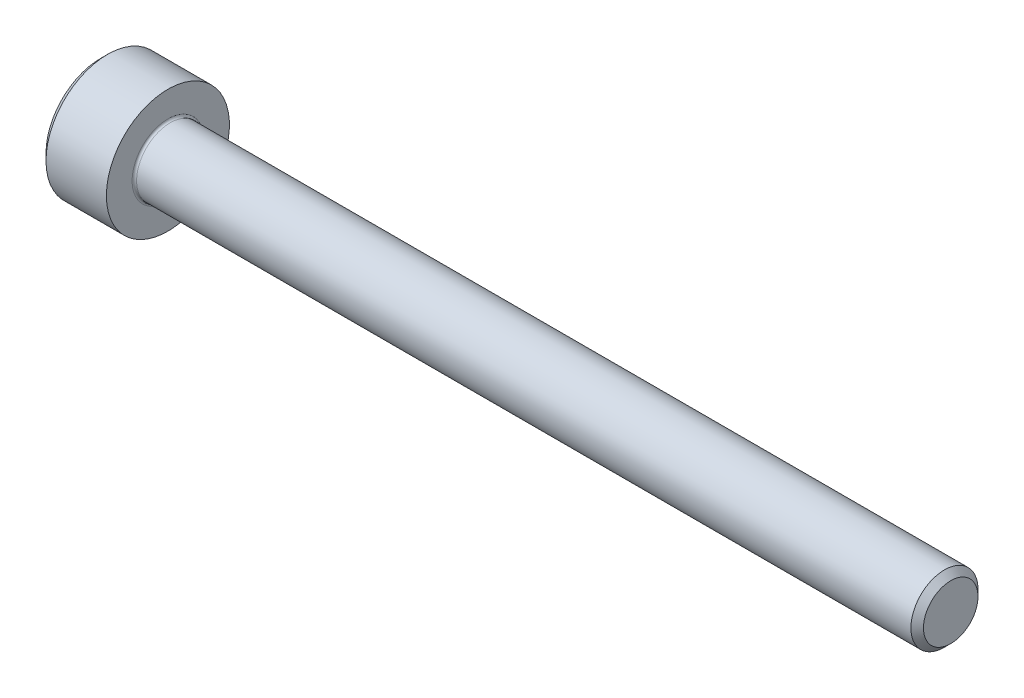
ISO-10303-21;
HEADER;
FILE_DESCRIPTION(('STEP AP214'),'2;1');
FILE_NAME('part.step','',(''),(''),'','','');
FILE_SCHEMA(('AUTOMOTIVE_DESIGN { 1 0 10303 214 1 1 1 1 }'));
ENDSEC;
DATA;
#1=APPLICATION_CONTEXT('core data for automotive mechanical design processes');
#2=APPLICATION_PROTOCOL_DEFINITION('international standard','automotive_design',2000,#1);
#3=PRODUCT_CONTEXT('',#1,'mechanical');
#4=PRODUCT('Part','Part','',(#3));
#5=PRODUCT_RELATED_PRODUCT_CATEGORY('part','',(#4));
#6=PRODUCT_DEFINITION_FORMATION('','',#4);
#7=PRODUCT_DEFINITION_CONTEXT('part definition',#1,'design');
#8=PRODUCT_DEFINITION('design','',#6,#7);
#9=PRODUCT_DEFINITION_SHAPE('','',#8);
#10=(LENGTH_UNIT() NAMED_UNIT(*) SI_UNIT(.MILLI.,.METRE.));
#11=(NAMED_UNIT(*) PLANE_ANGLE_UNIT() SI_UNIT($,.RADIAN.));
#12=(NAMED_UNIT(*) SI_UNIT($,.STERADIAN.) SOLID_ANGLE_UNIT());
#13=UNCERTAINTY_MEASURE_WITH_UNIT(LENGTH_MEASURE(1.E-05),#10,'distance_accuracy_value','');
#14=(GEOMETRIC_REPRESENTATION_CONTEXT(3) GLOBAL_UNCERTAINTY_ASSIGNED_CONTEXT((#13)) GLOBAL_UNIT_ASSIGNED_CONTEXT((#10,
#11,#12)) REPRESENTATION_CONTEXT('',''));
#15=CARTESIAN_POINT('',(0.,0.,0.));
#16=DIRECTION('',(0.,0.,1.));
#17=DIRECTION('',(1.,0.,0.));
#18=AXIS2_PLACEMENT_3D('',#15,#16,#17);
#19=CARTESIAN_POINT('',(0.,0.,0.));
#20=DIRECTION('',(-1.,0.,0.));
#21=DIRECTION('',(0.,0.,1.));
#22=AXIS2_PLACEMENT_3D('',#19,#20,#21);
#23=PLANE('',#22);
#24=DIRECTION('',(0.,-0.5,0.86602540378444));
#25=VECTOR('',#24,1.);
#26=CARTESIAN_POINT('',(0.,1.47801668912544,0.));
#27=LINE('',#26,#25);
#28=CARTESIAN_POINT('',(0.,1.47801668912544,0.));
#29=VERTEX_POINT('',#28);
#30=CARTESIAN_POINT('',(0.,0.73900834456272,1.28));
#31=VERTEX_POINT('',#30);
#32=EDGE_CURVE('E379',#29,#31,#27,.T.);
#33=ORIENTED_EDGE('',*,*,#32,.T.);
#34=DIRECTION('',(0.,1.,0.));
#35=VECTOR('',#34,1.);
#36=CARTESIAN_POINT('',(0.,-0.739008344562722,1.28));
#37=LINE('',#36,#35);
#38=CARTESIAN_POINT('',(0.,-0.739008344562722,1.28));
#39=VERTEX_POINT('',#38);
#40=EDGE_CURVE('E111',#39,#31,#37,.T.);
#41=ORIENTED_EDGE('',*,*,#40,.F.);
#42=DIRECTION('',(0.,-0.5,-0.866025403784438));
#43=VECTOR('',#42,1.);
#44=CARTESIAN_POINT('',(0.,-0.739008344562722,1.28));
#45=LINE('',#44,#43);
#46=CARTESIAN_POINT('',(0.,-1.47801668912544,0.));
#47=VERTEX_POINT('',#46);
#48=EDGE_CURVE('E382',#39,#47,#45,.T.);
#49=ORIENTED_EDGE('',*,*,#48,.T.);
#50=DIRECTION('',(0.,0.5,-0.86602540378444));
#51=VECTOR('',#50,1.);
#52=CARTESIAN_POINT('',(0.,-1.47801668912544,0.));
#53=LINE('',#52,#51);
#54=CARTESIAN_POINT('',(0.,-0.739008344562726,-1.28));
#55=VERTEX_POINT('',#54);
#56=EDGE_CURVE('E385',#47,#55,#53,.T.);
#57=ORIENTED_EDGE('',*,*,#56,.T.);
#58=DIRECTION('',(0.,-1.,0.));
#59=VECTOR('',#58,1.);
#60=CARTESIAN_POINT('',(0.,0.739008344562716,-1.28));
#61=LINE('',#60,#59);
#62=CARTESIAN_POINT('',(0.,0.739008344562716,-1.28));
#63=VERTEX_POINT('',#62);
#64=EDGE_CURVE('E388',#63,#55,#61,.T.);
#65=ORIENTED_EDGE('',*,*,#64,.F.);
#66=DIRECTION('',(0.,-0.5,-0.866025403784438));
#67=VECTOR('',#66,1.);
#68=CARTESIAN_POINT('',(0.,1.47801668912544,0.));
#69=LINE('',#68,#67);
#70=EDGE_CURVE('E106',#29,#63,#69,.T.);
#71=ORIENTED_EDGE('',*,*,#70,.F.);
#72=EDGE_LOOP('',(#33,#41,#49,#57,#65,#71));
#73=FACE_BOUND('',#72,.T.);
#74=CARTESIAN_POINT('',(0.,0.,0.));
#75=DIRECTION('',(-1.,0.,0.));
#76=DIRECTION('',(0.,0.,1.));
#77=AXIS2_PLACEMENT_3D('',#74,#75,#76);
#78=CIRCLE('',#77,2.45);
#79=CARTESIAN_POINT('',(0.,0.,2.45));
#80=VERTEX_POINT('',#79);
#81=EDGE_CURVE('E122',#80,#80,#78,.T.);
#82=ORIENTED_EDGE('',*,*,#81,.T.);
#83=EDGE_LOOP('',(#82));
#84=FACE_BOUND('',#83,.T.);
#85=ADVANCED_FACE('F19',(#73,#84),#23,.T.);
#86=CARTESIAN_POINT('',(38.,1.2195,0.));
#87=DIRECTION('',(1.,0.,0.));
#88=DIRECTION('',(0.,0.,-1.));
#89=AXIS2_PLACEMENT_3D('',#86,#87,#88);
#90=PLANE('',#89);
#91=CARTESIAN_POINT('',(38.,0.,0.));
#92=DIRECTION('',(-1.,0.,0.));
#93=DIRECTION('',(0.,0.,1.));
#94=AXIS2_PLACEMENT_3D('',#91,#92,#93);
#95=CIRCLE('',#94,1.2195);
#96=CARTESIAN_POINT('',(38.,0.,1.2195));
#97=VERTEX_POINT('',#96);
#98=EDGE_CURVE('E135',#97,#97,#95,.T.);
#99=ORIENTED_EDGE('',*,*,#98,.F.);
#100=EDGE_LOOP('',(#99));
#101=FACE_BOUND('',#100,.T.);
#102=ADVANCED_FACE('F157',(#101),#90,.T.);
#103=CARTESIAN_POINT('',(38.,0.,0.));
#104=DIRECTION('',(-1.,0.,0.));
#105=DIRECTION('',(0.,0.,1.));
#106=AXIS2_PLACEMENT_3D('',#103,#104,#105);
#107=CONICAL_SURFACE('',#106,1.2195,0.785398163397404);
#108=CARTESIAN_POINT('',(37.7195,0.,0.));
#109=DIRECTION('',(-1.,0.,0.));
#110=DIRECTION('',(0.,0.,1.));
#111=AXIS2_PLACEMENT_3D('',#108,#109,#110);
#112=CIRCLE('',#111,1.49999999999998);
#113=CARTESIAN_POINT('',(37.7195,0.,1.49999999999998));
#114=VERTEX_POINT('',#113);
#115=EDGE_CURVE('E132',#114,#114,#112,.T.);
#116=ORIENTED_EDGE('',*,*,#115,.F.);
#117=EDGE_LOOP('',(#116));
#118=FACE_BOUND('',#117,.T.);
#119=ORIENTED_EDGE('',*,*,#98,.T.);
#120=EDGE_LOOP('',(#119));
#121=FACE_BOUND('',#120,.T.);
#122=ADVANCED_FACE('F163',(#118,#121),#107,.T.);
#123=CARTESIAN_POINT('',(-31.75,0.,0.));
#124=DIRECTION('',(-1.,0.,0.));
#125=DIRECTION('',(0.,0.,1.));
#126=AXIS2_PLACEMENT_3D('',#123,#124,#125);
#127=CYLINDRICAL_SURFACE('',#126,1.5);
#128=CARTESIAN_POINT('',(3.1,0.,0.));
#129=DIRECTION('',(1.,0.,0.));
#130=DIRECTION('',(0.,0.,-1.));
#131=AXIS2_PLACEMENT_3D('',#128,#129,#130);
#132=CIRCLE('',#131,1.5);
#133=CARTESIAN_POINT('',(3.1,0.,-1.5));
#134=VERTEX_POINT('',#133);
#135=EDGE_CURVE('E11',#134,#134,#132,.T.);
#136=ORIENTED_EDGE('',*,*,#135,.T.);
#137=EDGE_LOOP('',(#136));
#138=FACE_BOUND('',#137,.T.);
#139=ORIENTED_EDGE('',*,*,#115,.T.);
#140=EDGE_LOOP('',(#139));
#141=FACE_BOUND('',#140,.T.);
#142=ADVANCED_FACE('F174',(#138,#141),#127,.T.);
#143=CARTESIAN_POINT('',(3.,2.75,0.));
#144=DIRECTION('',(1.,0.,0.));
#145=DIRECTION('',(0.,0.,-1.));
#146=AXIS2_PLACEMENT_3D('',#143,#144,#145);
#147=PLANE('',#146);
#148=CARTESIAN_POINT('',(3.,0.,0.));
#149=DIRECTION('',(1.,0.,0.));
#150=DIRECTION('',(0.,0.,-1.));
#151=AXIS2_PLACEMENT_3D('',#148,#149,#150);
#152=CIRCLE('',#151,1.6);
#153=CARTESIAN_POINT('',(3.,0.,-1.6));
#154=VERTEX_POINT('',#153);
#155=EDGE_CURVE('E27',#154,#154,#152,.F.);
#156=ORIENTED_EDGE('',*,*,#155,.T.);
#157=EDGE_LOOP('',(#156));
#158=FACE_BOUND('',#157,.T.);
#159=CARTESIAN_POINT('',(3.,0.,0.));
#160=DIRECTION('',(-1.,0.,0.));
#161=DIRECTION('',(0.,0.,1.));
#162=AXIS2_PLACEMENT_3D('',#159,#160,#161);
#163=CIRCLE('',#162,2.75);
#164=CARTESIAN_POINT('',(3.,0.,2.75));
#165=VERTEX_POINT('',#164);
#166=EDGE_CURVE('E129',#165,#165,#163,.T.);
#167=ORIENTED_EDGE('',*,*,#166,.F.);
#168=EDGE_LOOP('',(#167));
#169=FACE_BOUND('',#168,.T.);
#170=ADVANCED_FACE('F140',(#158,#169),#147,.T.);
#171=CARTESIAN_POINT('',(-31.75,0.,0.));
#172=DIRECTION('',(-1.,0.,0.));
#173=DIRECTION('',(0.,0.,1.));
#174=AXIS2_PLACEMENT_3D('',#171,#172,#173);
#175=CYLINDRICAL_SURFACE('',#174,2.75);
#176=ORIENTED_EDGE('',*,*,#166,.T.);
#177=EDGE_LOOP('',(#176));
#178=FACE_BOUND('',#177,.T.);
#179=CARTESIAN_POINT('',(0.3,0.,0.));
#180=DIRECTION('',(-1.,0.,0.));
#181=DIRECTION('',(0.,0.,1.));
#182=AXIS2_PLACEMENT_3D('',#179,#180,#181);
#183=CIRCLE('',#182,2.75);
#184=CARTESIAN_POINT('',(0.3,0.,2.75));
#185=VERTEX_POINT('',#184);
#186=EDGE_CURVE('E126',#185,#185,#183,.T.);
#187=ORIENTED_EDGE('',*,*,#186,.F.);
#188=EDGE_LOOP('',(#187));
#189=FACE_BOUND('',#188,.T.);
#190=ADVANCED_FACE('F152',(#178,#189),#175,.T.);
#191=CARTESIAN_POINT('',(0.,0.,0.));
#192=DIRECTION('',(1.,0.,0.));
#193=DIRECTION('',(0.,0.,-1.));
#194=AXIS2_PLACEMENT_3D('',#191,#192,#193);
#195=CONICAL_SURFACE('',#194,2.45,0.785398163397439);
#196=ORIENTED_EDGE('',*,*,#186,.T.);
#197=EDGE_LOOP('',(#196));
#198=FACE_BOUND('',#197,.T.);
#199=ORIENTED_EDGE('',*,*,#81,.F.);
#200=EDGE_LOOP('',(#199));
#201=FACE_BOUND('',#200,.T.);
#202=ADVANCED_FACE('F144',(#198,#201),#195,.T.);
#203=CARTESIAN_POINT('',(3.1,0.,0.));
#204=DIRECTION('',(1.,0.,0.));
#205=DIRECTION('',(0.,0.,-1.));
#206=AXIS2_PLACEMENT_3D('',#203,#204,#205);
#207=TOROIDAL_SURFACE('',#206,1.6,0.1);
#208=ORIENTED_EDGE('',*,*,#135,.F.);
#209=EDGE_LOOP('',(#208));
#210=FACE_BOUND('',#209,.T.);
#211=ORIENTED_EDGE('',*,*,#155,.F.);
#212=EDGE_LOOP('',(#211));
#213=FACE_BOUND('',#212,.T.);
#214=ADVANCED_FACE('F21',(#210,#213),#207,.F.);
#215=CARTESIAN_POINT('',(1.3,1.47801668912544,0.));
#216=DIRECTION('',(0.,-0.86602540378444,-0.5));
#217=DIRECTION('',(0.,0.5,-0.86602540378444));
#218=AXIS2_PLACEMENT_3D('',#215,#216,#217);
#219=PLANE('',#218);
#220=ORIENTED_EDGE('',*,*,#32,.F.);
#221=DIRECTION('',(-1.,0.,0.));
#222=VECTOR('',#221,1.);
#223=CARTESIAN_POINT('',(1.3,1.47801668912544,0.));
#224=LINE('',#223,#222);
#225=CARTESIAN_POINT('',(1.3,1.47801668912544,0.));
#226=VERTEX_POINT('',#225);
#227=EDGE_CURVE('E378',#226,#29,#224,.T.);
#228=ORIENTED_EDGE('',*,*,#227,.F.);
#229=DIRECTION('',(0.,-0.5,0.86602540378444));
#230=VECTOR('',#229,1.);
#231=CARTESIAN_POINT('',(1.3,1.47801668912544,0.));
#232=LINE('',#231,#230);
#233=CARTESIAN_POINT('',(1.3,1.10851251684408,0.64));
#234=VERTEX_POINT('',#233);
#235=EDGE_CURVE('E34',#226,#234,#232,.T.);
#236=ORIENTED_EDGE('',*,*,#235,.T.);
#237=CARTESIAN_POINT('',(1.3,0.73900834456272,1.28));
#238=VERTEX_POINT('',#237);
#239=EDGE_CURVE('E92',#234,#238,#232,.T.);
#240=ORIENTED_EDGE('',*,*,#239,.T.);
#241=DIRECTION('',(-1.,0.,0.));
#242=VECTOR('',#241,1.);
#243=CARTESIAN_POINT('',(1.3,0.73900834456272,1.28));
#244=LINE('',#243,#242);
#245=EDGE_CURVE('E104',#238,#31,#244,.T.);
#246=ORIENTED_EDGE('',*,*,#245,.T.);
#247=EDGE_LOOP('',(#220,#228,#236,#240,#246));
#248=FACE_BOUND('',#247,.T.);
#249=ADVANCED_FACE('F103',(#248),#219,.T.);
#250=CARTESIAN_POINT('',(1.3,-0.739008344562722,1.28));
#251=DIRECTION('',(0.,0.,1.));
#252=DIRECTION('',(0.,-1.,0.));
#253=AXIS2_PLACEMENT_3D('',#250,#251,#252);
#254=PLANE('',#253);
#255=ORIENTED_EDGE('',*,*,#40,.T.);
#256=ORIENTED_EDGE('',*,*,#245,.F.);
#257=DIRECTION('',(0.,1.,0.));
#258=VECTOR('',#257,1.);
#259=CARTESIAN_POINT('',(1.3,-0.739008344562722,1.28));
#260=LINE('',#259,#258);
#261=CARTESIAN_POINT('',(1.3,0.,1.28));
#262=VERTEX_POINT('',#261);
#263=EDGE_CURVE('E90',#262,#238,#260,.T.);
#264=ORIENTED_EDGE('',*,*,#263,.F.);
#265=CARTESIAN_POINT('',(1.3,-0.739008344562722,1.28));
#266=VERTEX_POINT('',#265);
#267=EDGE_CURVE('E100',#266,#262,#260,.T.);
#268=ORIENTED_EDGE('',*,*,#267,.F.);
#269=DIRECTION('',(-1.,0.,0.));
#270=VECTOR('',#269,1.);
#271=CARTESIAN_POINT('',(1.3,-0.739008344562722,1.28));
#272=LINE('',#271,#270);
#273=EDGE_CURVE('E113',#266,#39,#272,.T.);
#274=ORIENTED_EDGE('',*,*,#273,.T.);
#275=EDGE_LOOP('',(#255,#256,#264,#268,#274));
#276=FACE_BOUND('',#275,.T.);
#277=ADVANCED_FACE('F108',(#276),#254,.F.);
#278=CARTESIAN_POINT('',(1.3,-0.739008344562722,1.28));
#279=DIRECTION('',(0.,0.866025403784438,-0.5));
#280=DIRECTION('',(0.,0.5,0.866025403784438));
#281=AXIS2_PLACEMENT_3D('',#278,#279,#280);
#282=PLANE('',#281);
#283=ORIENTED_EDGE('',*,*,#48,.F.);
#284=ORIENTED_EDGE('',*,*,#273,.F.);
#285=DIRECTION('',(0.,-0.5,-0.866025403784438));
#286=VECTOR('',#285,1.);
#287=CARTESIAN_POINT('',(1.3,-0.739008344562722,1.28));
#288=LINE('',#287,#286);
#289=CARTESIAN_POINT('',(1.3,-1.10851251684408,0.64));
#290=VERTEX_POINT('',#289);
#291=EDGE_CURVE('E357',#266,#290,#288,.T.);
#292=ORIENTED_EDGE('',*,*,#291,.T.);
#293=CARTESIAN_POINT('',(1.3,-1.47801668912544,0.));
#294=VERTEX_POINT('',#293);
#295=EDGE_CURVE('E359',#290,#294,#288,.T.);
#296=ORIENTED_EDGE('',*,*,#295,.T.);
#297=DIRECTION('',(-1.,0.,0.));
#298=VECTOR('',#297,1.);
#299=CARTESIAN_POINT('',(1.3,-1.47801668912544,0.));
#300=LINE('',#299,#298);
#301=EDGE_CURVE('E118',#294,#47,#300,.T.);
#302=ORIENTED_EDGE('',*,*,#301,.T.);
#303=EDGE_LOOP('',(#283,#284,#292,#296,#302));
#304=FACE_BOUND('',#303,.T.);
#305=ADVANCED_FACE('F234',(#304),#282,.T.);
#306=CARTESIAN_POINT('',(1.3,-1.47801668912544,0.));
#307=DIRECTION('',(0.,0.86602540378444,0.5));
#308=DIRECTION('',(0.,-0.5,0.86602540378444));
#309=AXIS2_PLACEMENT_3D('',#306,#307,#308);
#310=PLANE('',#309);
#311=ORIENTED_EDGE('',*,*,#56,.F.);
#312=ORIENTED_EDGE('',*,*,#301,.F.);
#313=DIRECTION('',(0.,0.5,-0.86602540378444));
#314=VECTOR('',#313,1.);
#315=CARTESIAN_POINT('',(1.3,-1.47801668912544,0.));
#316=LINE('',#315,#314);
#317=CARTESIAN_POINT('',(1.3,-1.10851251684409,-0.64));
#318=VERTEX_POINT('',#317);
#319=EDGE_CURVE('E362',#294,#318,#316,.T.);
#320=ORIENTED_EDGE('',*,*,#319,.T.);
#321=CARTESIAN_POINT('',(1.3,-0.739008344562726,-1.28));
#322=VERTEX_POINT('',#321);
#323=EDGE_CURVE('E366',#318,#322,#316,.T.);
#324=ORIENTED_EDGE('',*,*,#323,.T.);
#325=DIRECTION('',(-1.,0.,0.));
#326=VECTOR('',#325,1.);
#327=CARTESIAN_POINT('',(1.3,-0.739008344562726,-1.28));
#328=LINE('',#327,#326);
#329=EDGE_CURVE('E397',#322,#55,#328,.T.);
#330=ORIENTED_EDGE('',*,*,#329,.T.);
#331=EDGE_LOOP('',(#311,#312,#320,#324,#330));
#332=FACE_BOUND('',#331,.T.);
#333=ADVANCED_FACE('F244',(#332),#310,.T.);
#334=CARTESIAN_POINT('',(1.3,0.739008344562716,-1.28));
#335=DIRECTION('',(0.,0.,-1.));
#336=DIRECTION('',(0.,1.,0.));
#337=AXIS2_PLACEMENT_3D('',#334,#335,#336);
#338=PLANE('',#337);
#339=ORIENTED_EDGE('',*,*,#64,.T.);
#340=ORIENTED_EDGE('',*,*,#329,.F.);
#341=DIRECTION('',(0.,-1.,0.));
#342=VECTOR('',#341,1.);
#343=CARTESIAN_POINT('',(1.3,0.739008344562716,-1.28));
#344=LINE('',#343,#342);
#345=CARTESIAN_POINT('',(1.3,0.,-1.28));
#346=VERTEX_POINT('',#345);
#347=EDGE_CURVE('E370',#346,#322,#344,.T.);
#348=ORIENTED_EDGE('',*,*,#347,.F.);
#349=CARTESIAN_POINT('',(1.3,0.739008344562716,-1.28));
#350=VERTEX_POINT('',#349);
#351=EDGE_CURVE('E371',#350,#346,#344,.T.);
#352=ORIENTED_EDGE('',*,*,#351,.F.);
#353=DIRECTION('',(-1.,0.,0.));
#354=VECTOR('',#353,1.);
#355=CARTESIAN_POINT('',(1.3,0.739008344562716,-1.28));
#356=LINE('',#355,#354);
#357=EDGE_CURVE('E394',#350,#63,#356,.T.);
#358=ORIENTED_EDGE('',*,*,#357,.T.);
#359=EDGE_LOOP('',(#339,#340,#348,#352,#358));
#360=FACE_BOUND('',#359,.T.);
#361=ADVANCED_FACE('F254',(#360),#338,.F.);
#362=CARTESIAN_POINT('',(1.3,1.47801668912544,0.));
#363=DIRECTION('',(0.,0.866025403784438,-0.5));
#364=DIRECTION('',(0.,0.5,0.866025403784438));
#365=AXIS2_PLACEMENT_3D('',#362,#363,#364);
#366=PLANE('',#365);
#367=ORIENTED_EDGE('',*,*,#70,.T.);
#368=ORIENTED_EDGE('',*,*,#357,.F.);
#369=DIRECTION('',(0.,-0.5,-0.866025403784438));
#370=VECTOR('',#369,1.);
#371=CARTESIAN_POINT('',(1.3,1.47801668912544,0.));
#372=LINE('',#371,#370);
#373=CARTESIAN_POINT('',(1.3,1.10851251684408,-0.64));
#374=VERTEX_POINT('',#373);
#375=EDGE_CURVE('E374',#374,#350,#372,.T.);
#376=ORIENTED_EDGE('',*,*,#375,.F.);
#377=EDGE_CURVE('E375',#226,#374,#372,.T.);
#378=ORIENTED_EDGE('',*,*,#377,.F.);
#379=ORIENTED_EDGE('',*,*,#227,.T.);
#380=EDGE_LOOP('',(#367,#368,#376,#378,#379));
#381=FACE_BOUND('',#380,.T.);
#382=ADVANCED_FACE('F264',(#381),#366,.F.);
#383=CARTESIAN_POINT('',(1.3,0.73900834456272,1.28));
#384=DIRECTION('',(-1.,0.,0.));
#385=DIRECTION('',(0.,0.,1.));
#386=AXIS2_PLACEMENT_3D('',#383,#384,#385);
#387=PLANE('',#386);
#388=CARTESIAN_POINT('',(1.3,0.,0.));
#389=DIRECTION('',(-1.,0.,0.));
#390=DIRECTION('',(0.,0.,1.));
#391=AXIS2_PLACEMENT_3D('',#388,#389,#390);
#392=CIRCLE('',#391,1.28);
#393=EDGE_CURVE('E112',#290,#262,#392,.T.);
#394=ORIENTED_EDGE('',*,*,#393,.F.);
#395=ORIENTED_EDGE('',*,*,#291,.F.);
#396=ORIENTED_EDGE('',*,*,#267,.T.);
#397=EDGE_LOOP('',(#394,#395,#396));
#398=FACE_BOUND('',#397,.T.);
#399=ADVANCED_FACE('F274',(#398),#387,.T.);
#400=EDGE_CURVE('E116',#318,#290,#392,.T.);
#401=ORIENTED_EDGE('',*,*,#400,.F.);
#402=ORIENTED_EDGE('',*,*,#319,.F.);
#403=ORIENTED_EDGE('',*,*,#295,.F.);
#404=EDGE_LOOP('',(#401,#402,#403));
#405=FACE_BOUND('',#404,.T.);
#406=ADVANCED_FACE('F284',(#405),#387,.T.);
#407=EDGE_CURVE('E405',#346,#318,#392,.T.);
#408=ORIENTED_EDGE('',*,*,#407,.F.);
#409=ORIENTED_EDGE('',*,*,#347,.T.);
#410=ORIENTED_EDGE('',*,*,#323,.F.);
#411=EDGE_LOOP('',(#408,#409,#410));
#412=FACE_BOUND('',#411,.T.);
#413=ADVANCED_FACE('F294',(#412),#387,.T.);
#414=EDGE_CURVE('E404',#374,#346,#392,.T.);
#415=ORIENTED_EDGE('',*,*,#414,.F.);
#416=ORIENTED_EDGE('',*,*,#375,.T.);
#417=ORIENTED_EDGE('',*,*,#351,.T.);
#418=EDGE_LOOP('',(#415,#416,#417));
#419=FACE_BOUND('',#418,.T.);
#420=ADVANCED_FACE('F303',(#419),#387,.T.);
#421=EDGE_CURVE('E123',#234,#374,#392,.T.);
#422=ORIENTED_EDGE('',*,*,#421,.F.);
#423=ORIENTED_EDGE('',*,*,#235,.F.);
#424=ORIENTED_EDGE('',*,*,#377,.T.);
#425=EDGE_LOOP('',(#422,#423,#424));
#426=FACE_BOUND('',#425,.T.);
#427=ADVANCED_FACE('F312',(#426),#387,.T.);
#428=EDGE_CURVE('E95',#262,#234,#392,.T.);
#429=ORIENTED_EDGE('',*,*,#428,.F.);
#430=ORIENTED_EDGE('',*,*,#263,.T.);
#431=ORIENTED_EDGE('',*,*,#239,.F.);
#432=EDGE_LOOP('',(#429,#430,#431));
#433=FACE_BOUND('',#432,.T.);
#434=ADVANCED_FACE('F91',(#433),#387,.T.);
#435=CARTESIAN_POINT('',(1.3,0.,0.));
#436=DIRECTION('',(-1.,0.,0.));
#437=DIRECTION('',(0.,0.,1.));
#438=AXIS2_PLACEMENT_3D('',#435,#436,#437);
#439=CONICAL_SURFACE('',#438,1.28,1.0471975511966);
#440=CARTESIAN_POINT('',(2.03900834456273,0.,0.));
#441=VERTEX_POINT('',#440);
#442=VERTEX_LOOP('',#441);
#443=FACE_BOUND('',#442,.T.);
#444=ORIENTED_EDGE('',*,*,#428,.T.);
#445=ORIENTED_EDGE('',*,*,#421,.T.);
#446=ORIENTED_EDGE('',*,*,#414,.T.);
#447=ORIENTED_EDGE('',*,*,#407,.T.);
#448=ORIENTED_EDGE('',*,*,#400,.T.);
#449=ORIENTED_EDGE('',*,*,#393,.T.);
#450=EDGE_LOOP('',(#444,#445,#446,#447,#448,#449));
#451=FACE_BOUND('',#450,.T.);
#452=ADVANCED_FACE('F167',(#443,#451),#439,.F.);
#453=CLOSED_SHELL('',(#85,#102,#122,#142,#170,#190,#202,#214,#249,#277,#305,#333,#361,#382,#399,
#406,#413,#420,#427,#434,#452));
#454=MANIFOLD_SOLID_BREP('B1',#453);
#455=ADVANCED_BREP_SHAPE_REPRESENTATION('',(#18,#454),#14);
#456=SHAPE_DEFINITION_REPRESENTATION(#9,#455);
ENDSEC;
END-ISO-10303-21;
